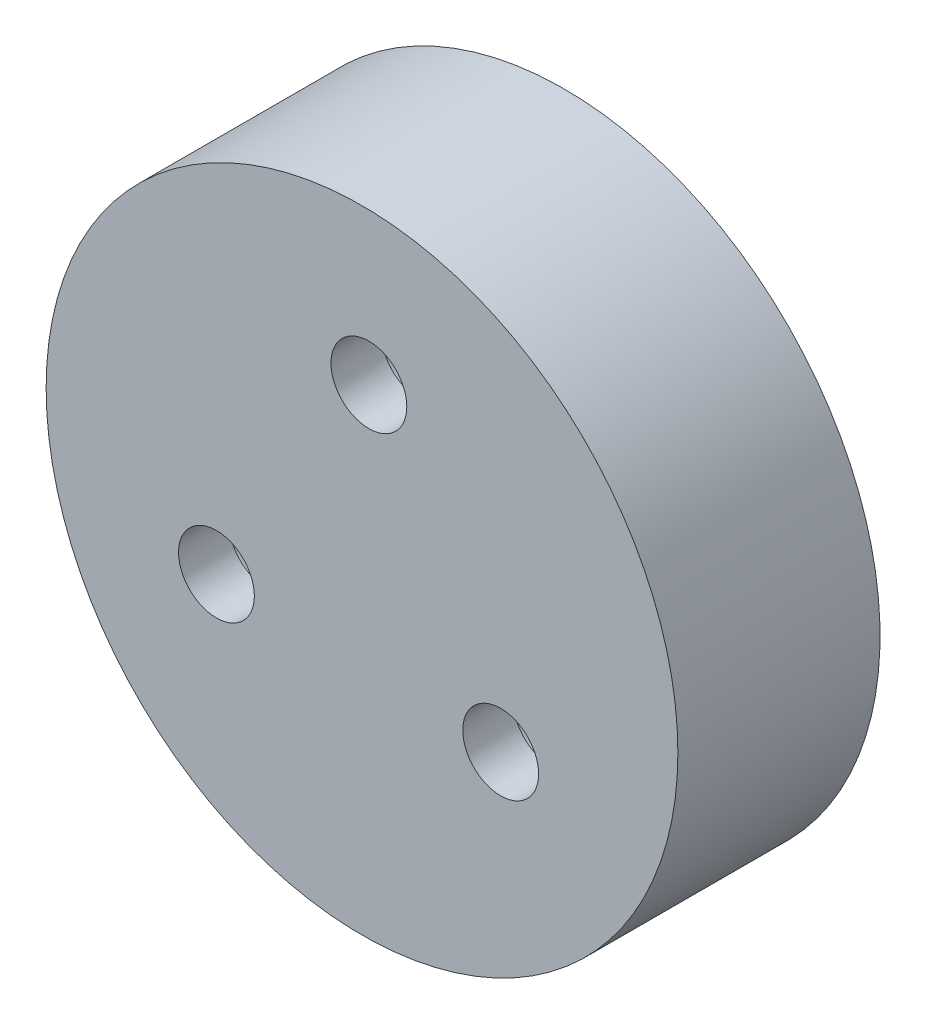
ISO-10303-21;
HEADER;
FILE_DESCRIPTION(('STEP AP214'),'2;1');
FILE_NAME('part.step','',(''),(''),'','','');
FILE_SCHEMA(('AUTOMOTIVE_DESIGN { 1 0 10303 214 1 1 1 1 }'));
ENDSEC;
DATA;
#1=APPLICATION_CONTEXT('core data for automotive mechanical design processes');
#2=APPLICATION_PROTOCOL_DEFINITION('international standard','automotive_design',2000,#1);
#3=PRODUCT_CONTEXT('',#1,'mechanical');
#4=PRODUCT('Part','Part','',(#3));
#5=PRODUCT_RELATED_PRODUCT_CATEGORY('part','',(#4));
#6=PRODUCT_DEFINITION_FORMATION('','',#4);
#7=PRODUCT_DEFINITION_CONTEXT('part definition',#1,'design');
#8=PRODUCT_DEFINITION('design','',#6,#7);
#9=PRODUCT_DEFINITION_SHAPE('','',#8);
#10=(LENGTH_UNIT() NAMED_UNIT(*) SI_UNIT(.MILLI.,.METRE.));
#11=(NAMED_UNIT(*) PLANE_ANGLE_UNIT() SI_UNIT($,.RADIAN.));
#12=(NAMED_UNIT(*) SI_UNIT($,.STERADIAN.) SOLID_ANGLE_UNIT());
#13=UNCERTAINTY_MEASURE_WITH_UNIT(LENGTH_MEASURE(1.E-05),#10,'distance_accuracy_value','');
#14=(GEOMETRIC_REPRESENTATION_CONTEXT(3) GLOBAL_UNCERTAINTY_ASSIGNED_CONTEXT((#13)) GLOBAL_UNIT_ASSIGNED_CONTEXT((#10,
#11,#12)) REPRESENTATION_CONTEXT('',''));
#15=CARTESIAN_POINT('',(0.,0.,0.));
#16=DIRECTION('',(0.,0.,1.));
#17=DIRECTION('',(1.,0.,0.));
#18=AXIS2_PLACEMENT_3D('',#15,#16,#17);
#19=CARTESIAN_POINT('',(-5.76029822902629,-3.0114721172006,15.));
#20=DIRECTION('',(0.,0.,-1.));
#21=DIRECTION('',(-1.,0.,0.));
#22=AXIS2_PLACEMENT_3D('',#19,#20,#21);
#23=CYLINDRICAL_SURFACE('',#22,1.5);
#24=CARTESIAN_POINT('',(-5.76029822902629,-3.0114721172006,6.));
#25=DIRECTION('',(0.,0.,1.));
#26=DIRECTION('',(1.,0.,0.));
#27=AXIS2_PLACEMENT_3D('',#24,#25,#26);
#28=CIRCLE('',#27,1.5);
#29=CARTESIAN_POINT('',(-4.26029822902629,-3.0114721172006,6.));
#30=VERTEX_POINT('',#29);
#31=EDGE_CURVE('E70',#30,#30,#28,.T.);
#32=ORIENTED_EDGE('',*,*,#31,.T.);
#33=EDGE_LOOP('',(#32));
#34=FACE_BOUND('',#33,.T.);
#35=CARTESIAN_POINT('',(-5.76029822902629,-3.0114721172006,4.));
#36=DIRECTION('',(0.,0.,-1.));
#37=DIRECTION('',(-1.,0.,0.));
#38=AXIS2_PLACEMENT_3D('',#35,#36,#37);
#39=CIRCLE('',#38,1.5);
#40=CARTESIAN_POINT('',(-7.26029822902629,-3.0114721172006,4.));
#41=VERTEX_POINT('',#40);
#42=EDGE_CURVE('E34',#41,#41,#39,.F.);
#43=ORIENTED_EDGE('',*,*,#42,.F.);
#44=EDGE_LOOP('',(#43));
#45=FACE_BOUND('',#44,.T.);
#46=ADVANCED_FACE('F30',(#34,#45),#23,.F.);
#47=CARTESIAN_POINT('',(5.48816047079737,-3.48282854111097,15.));
#48=DIRECTION('',(0.,0.,-1.));
#49=DIRECTION('',(-1.,0.,0.));
#50=AXIS2_PLACEMENT_3D('',#47,#48,#49);
#51=CYLINDRICAL_SURFACE('',#50,1.5);
#52=CARTESIAN_POINT('',(5.48816047079737,-3.48282854111097,6.));
#53=DIRECTION('',(0.,0.,1.));
#54=DIRECTION('',(1.,0.,0.));
#55=AXIS2_PLACEMENT_3D('',#52,#53,#54);
#56=CIRCLE('',#55,1.5);
#57=CARTESIAN_POINT('',(6.98816047079737,-3.48282854111097,6.));
#58=VERTEX_POINT('',#57);
#59=EDGE_CURVE('E43',#58,#58,#56,.T.);
#60=ORIENTED_EDGE('',*,*,#59,.T.);
#61=EDGE_LOOP('',(#60));
#62=FACE_BOUND('',#61,.T.);
#63=CARTESIAN_POINT('',(5.48816047079737,-3.48282854111097,4.));
#64=DIRECTION('',(0.,0.,-1.));
#65=DIRECTION('',(-1.,0.,0.));
#66=AXIS2_PLACEMENT_3D('',#63,#64,#65);
#67=CIRCLE('',#66,1.5);
#68=CARTESIAN_POINT('',(3.98816047079737,-3.48282854111097,4.));
#69=VERTEX_POINT('',#68);
#70=EDGE_CURVE('E49',#69,#69,#67,.F.);
#71=ORIENTED_EDGE('',*,*,#70,.F.);
#72=EDGE_LOOP('',(#71));
#73=FACE_BOUND('',#72,.T.);
#74=ADVANCED_FACE('F75',(#62,#73),#51,.F.);
#75=CARTESIAN_POINT('',(0.272137758228912,6.49430065831158,15.));
#76=DIRECTION('',(0.,0.,-1.));
#77=DIRECTION('',(-1.,0.,0.));
#78=AXIS2_PLACEMENT_3D('',#75,#76,#77);
#79=CYLINDRICAL_SURFACE('',#78,1.5);
#80=CARTESIAN_POINT('',(0.272137758228912,6.49430065831158,6.));
#81=DIRECTION('',(0.,0.,1.));
#82=DIRECTION('',(1.,0.,0.));
#83=AXIS2_PLACEMENT_3D('',#80,#81,#82);
#84=CIRCLE('',#83,1.5);
#85=CARTESIAN_POINT('',(1.77213775822891,6.49430065831158,6.));
#86=VERTEX_POINT('',#85);
#87=EDGE_CURVE('E38',#86,#86,#84,.T.);
#88=ORIENTED_EDGE('',*,*,#87,.T.);
#89=EDGE_LOOP('',(#88));
#90=FACE_BOUND('',#89,.T.);
#91=CARTESIAN_POINT('',(0.272137758228912,6.49430065831158,4.));
#92=DIRECTION('',(0.,0.,-1.));
#93=DIRECTION('',(-1.,0.,0.));
#94=AXIS2_PLACEMENT_3D('',#91,#92,#93);
#95=CIRCLE('',#94,1.5);
#96=CARTESIAN_POINT('',(-1.22786224177109,6.49430065831158,4.));
#97=VERTEX_POINT('',#96);
#98=EDGE_CURVE('E47',#97,#97,#95,.F.);
#99=ORIENTED_EDGE('',*,*,#98,.F.);
#100=EDGE_LOOP('',(#99));
#101=FACE_BOUND('',#100,.T.);
#102=ADVANCED_FACE('F92',(#90,#101),#79,.F.);
#103=CARTESIAN_POINT('',(0.,0.,0.));
#104=DIRECTION('',(0.,0.,1.));
#105=DIRECTION('',(1.,0.,0.));
#106=AXIS2_PLACEMENT_3D('',#103,#104,#105);
#107=PLANE('',#106);
#108=CARTESIAN_POINT('',(0.272137758228912,6.49430065831158,0.));
#109=DIRECTION('',(0.,0.,-1.));
#110=DIRECTION('',(-1.,0.,0.));
#111=AXIS2_PLACEMENT_3D('',#108,#109,#110);
#112=CIRCLE('',#111,2.5);
#113=CARTESIAN_POINT('',(-2.22786224177109,6.49430065831158,0.));
#114=VERTEX_POINT('',#113);
#115=EDGE_CURVE('E107',#114,#114,#112,.T.);
#116=ORIENTED_EDGE('',*,*,#115,.F.);
#117=EDGE_LOOP('',(#116));
#118=FACE_BOUND('',#117,.T.);
#119=CARTESIAN_POINT('',(-5.76029822902629,-3.0114721172006,0.));
#120=DIRECTION('',(0.,0.,-1.));
#121=DIRECTION('',(-1.,0.,0.));
#122=AXIS2_PLACEMENT_3D('',#119,#120,#121);
#123=CIRCLE('',#122,2.5);
#124=CARTESIAN_POINT('',(-8.26029822902629,-3.0114721172006,0.));
#125=VERTEX_POINT('',#124);
#126=EDGE_CURVE('E111',#125,#125,#123,.T.);
#127=ORIENTED_EDGE('',*,*,#126,.F.);
#128=EDGE_LOOP('',(#127));
#129=FACE_BOUND('',#128,.T.);
#130=CARTESIAN_POINT('',(5.48816047079737,-3.48282854111097,0.));
#131=DIRECTION('',(0.,0.,-1.));
#132=DIRECTION('',(-1.,0.,0.));
#133=AXIS2_PLACEMENT_3D('',#130,#131,#132);
#134=CIRCLE('',#133,2.5);
#135=CARTESIAN_POINT('',(2.98816047079737,-3.48282854111097,0.));
#136=VERTEX_POINT('',#135);
#137=EDGE_CURVE('E114',#136,#136,#134,.T.);
#138=ORIENTED_EDGE('',*,*,#137,.F.);
#139=EDGE_LOOP('',(#138));
#140=FACE_BOUND('',#139,.T.);
#141=CARTESIAN_POINT('',(0.,0.,0.));
#142=DIRECTION('',(0.,0.,-1.));
#143=DIRECTION('',(-1.,0.,0.));
#144=AXIS2_PLACEMENT_3D('',#141,#142,#143);
#145=CIRCLE('',#144,10.);
#146=CARTESIAN_POINT('',(-10.,0.,0.));
#147=VERTEX_POINT('',#146);
#148=EDGE_CURVE('E55',#147,#147,#145,.T.);
#149=ORIENTED_EDGE('',*,*,#148,.T.);
#150=EDGE_LOOP('',(#149));
#151=FACE_BOUND('',#150,.T.);
#152=ADVANCED_FACE('F95',(#118,#129,#140,#151),#107,.F.);
#153=CARTESIAN_POINT('',(0.,0.,6.));
#154=DIRECTION('',(0.,0.,-1.));
#155=DIRECTION('',(-1.,0.,0.));
#156=AXIS2_PLACEMENT_3D('',#153,#154,#155);
#157=CYLINDRICAL_SURFACE('',#156,12.5);
#158=CARTESIAN_POINT('',(0.,0.,6.));
#159=DIRECTION('',(0.,0.,1.));
#160=DIRECTION('',(1.,0.,0.));
#161=AXIS2_PLACEMENT_3D('',#158,#159,#160);
#162=CIRCLE('',#161,12.5);
#163=CARTESIAN_POINT('',(12.5,0.,6.));
#164=VERTEX_POINT('',#163);
#165=EDGE_CURVE('E10',#164,#164,#162,.T.);
#166=ORIENTED_EDGE('',*,*,#165,.F.);
#167=EDGE_LOOP('',(#166));
#168=FACE_BOUND('',#167,.T.);
#169=CARTESIAN_POINT('',(0.,0.,-2.));
#170=DIRECTION('',(0.,0.,-1.));
#171=DIRECTION('',(-1.,0.,0.));
#172=AXIS2_PLACEMENT_3D('',#169,#170,#171);
#173=CIRCLE('',#172,12.5);
#174=CARTESIAN_POINT('',(-12.5,0.,-2.));
#175=VERTEX_POINT('',#174);
#176=EDGE_CURVE('E64',#175,#175,#173,.T.);
#177=ORIENTED_EDGE('',*,*,#176,.F.);
#178=EDGE_LOOP('',(#177));
#179=FACE_BOUND('',#178,.T.);
#180=ADVANCED_FACE('F32',(#168,#179),#157,.T.);
#181=CARTESIAN_POINT('',(0.,0.,6.));
#182=DIRECTION('',(0.,0.,1.));
#183=DIRECTION('',(1.,0.,0.));
#184=AXIS2_PLACEMENT_3D('',#181,#182,#183);
#185=PLANE('',#184);
#186=ORIENTED_EDGE('',*,*,#87,.F.);
#187=EDGE_LOOP('',(#186));
#188=FACE_BOUND('',#187,.T.);
#189=ORIENTED_EDGE('',*,*,#59,.F.);
#190=EDGE_LOOP('',(#189));
#191=FACE_BOUND('',#190,.T.);
#192=ORIENTED_EDGE('',*,*,#31,.F.);
#193=EDGE_LOOP('',(#192));
#194=FACE_BOUND('',#193,.T.);
#195=ORIENTED_EDGE('',*,*,#165,.T.);
#196=EDGE_LOOP('',(#195));
#197=FACE_BOUND('',#196,.T.);
#198=ADVANCED_FACE('F78',(#188,#191,#194,#197),#185,.T.);
#199=CARTESIAN_POINT('',(0.,0.,-2.));
#200=DIRECTION('',(0.,0.,-1.));
#201=DIRECTION('',(-1.,0.,0.));
#202=AXIS2_PLACEMENT_3D('',#199,#200,#201);
#203=PLANE('',#202);
#204=ORIENTED_EDGE('',*,*,#176,.T.);
#205=EDGE_LOOP('',(#204));
#206=FACE_BOUND('',#205,.T.);
#207=CARTESIAN_POINT('',(0.,0.,-2.));
#208=DIRECTION('',(0.,0.,-1.));
#209=DIRECTION('',(-1.,0.,0.));
#210=AXIS2_PLACEMENT_3D('',#207,#208,#209);
#211=CIRCLE('',#210,10.);
#212=CARTESIAN_POINT('',(-10.,0.,-2.));
#213=VERTEX_POINT('',#212);
#214=EDGE_CURVE('E59',#213,#213,#211,.T.);
#215=ORIENTED_EDGE('',*,*,#214,.F.);
#216=EDGE_LOOP('',(#215));
#217=FACE_BOUND('',#216,.T.);
#218=ADVANCED_FACE('F81',(#206,#217),#203,.T.);
#219=CARTESIAN_POINT('',(0.,0.,-2.));
#220=DIRECTION('',(0.,0.,1.));
#221=DIRECTION('',(1.,0.,0.));
#222=AXIS2_PLACEMENT_3D('',#219,#220,#221);
#223=CYLINDRICAL_SURFACE('',#222,10.);
#224=ORIENTED_EDGE('',*,*,#214,.T.);
#225=EDGE_LOOP('',(#224));
#226=FACE_BOUND('',#225,.T.);
#227=ORIENTED_EDGE('',*,*,#148,.F.);
#228=EDGE_LOOP('',(#227));
#229=FACE_BOUND('',#228,.T.);
#230=ADVANCED_FACE('F143',(#226,#229),#223,.F.);
#231=CARTESIAN_POINT('',(0.272137758228912,6.49430065831158,4.));
#232=DIRECTION('',(0.,0.,-1.));
#233=DIRECTION('',(-1.,0.,0.));
#234=AXIS2_PLACEMENT_3D('',#231,#232,#233);
#235=PLANE('',#234);
#236=CARTESIAN_POINT('',(0.272137758228912,6.49430065831158,4.));
#237=DIRECTION('',(0.,0.,-1.));
#238=DIRECTION('',(-1.,0.,0.));
#239=AXIS2_PLACEMENT_3D('',#236,#237,#238);
#240=CIRCLE('',#239,2.5);
#241=CARTESIAN_POINT('',(-2.22786224177109,6.49430065831158,4.));
#242=VERTEX_POINT('',#241);
#243=EDGE_CURVE('E50',#242,#242,#240,.T.);
#244=ORIENTED_EDGE('',*,*,#243,.T.);
#245=EDGE_LOOP('',(#244));
#246=FACE_BOUND('',#245,.T.);
#247=ORIENTED_EDGE('',*,*,#98,.T.);
#248=EDGE_LOOP('',(#247));
#249=FACE_BOUND('',#248,.T.);
#250=ADVANCED_FACE('F128',(#246,#249),#235,.T.);
#251=CARTESIAN_POINT('',(0.272137758228912,6.49430065831158,4.));
#252=DIRECTION('',(0.,0.,-1.));
#253=DIRECTION('',(-1.,0.,0.));
#254=AXIS2_PLACEMENT_3D('',#251,#252,#253);
#255=CYLINDRICAL_SURFACE('',#254,2.5);
#256=ORIENTED_EDGE('',*,*,#243,.F.);
#257=EDGE_LOOP('',(#256));
#258=FACE_BOUND('',#257,.T.);
#259=ORIENTED_EDGE('',*,*,#115,.T.);
#260=EDGE_LOOP('',(#259));
#261=FACE_BOUND('',#260,.T.);
#262=ADVANCED_FACE('F131',(#258,#261),#255,.F.);
#263=CARTESIAN_POINT('',(5.48816047079737,-3.48282854111097,4.));
#264=DIRECTION('',(0.,0.,-1.));
#265=DIRECTION('',(-1.,0.,0.));
#266=AXIS2_PLACEMENT_3D('',#263,#264,#265);
#267=PLANE('',#266);
#268=CARTESIAN_POINT('',(5.48816047079737,-3.48282854111097,4.));
#269=DIRECTION('',(0.,0.,-1.));
#270=DIRECTION('',(-1.,0.,0.));
#271=AXIS2_PLACEMENT_3D('',#268,#269,#270);
#272=CIRCLE('',#271,2.5);
#273=CARTESIAN_POINT('',(2.98816047079737,-3.48282854111097,4.));
#274=VERTEX_POINT('',#273);
#275=EDGE_CURVE('E116',#274,#274,#272,.T.);
#276=ORIENTED_EDGE('',*,*,#275,.T.);
#277=EDGE_LOOP('',(#276));
#278=FACE_BOUND('',#277,.T.);
#279=ORIENTED_EDGE('',*,*,#70,.T.);
#280=EDGE_LOOP('',(#279));
#281=FACE_BOUND('',#280,.T.);
#282=ADVANCED_FACE('F134',(#278,#281),#267,.T.);
#283=CARTESIAN_POINT('',(5.48816047079737,-3.48282854111097,4.));
#284=DIRECTION('',(0.,0.,-1.));
#285=DIRECTION('',(-1.,0.,0.));
#286=AXIS2_PLACEMENT_3D('',#283,#284,#285);
#287=CYLINDRICAL_SURFACE('',#286,2.5);
#288=ORIENTED_EDGE('',*,*,#275,.F.);
#289=EDGE_LOOP('',(#288));
#290=FACE_BOUND('',#289,.T.);
#291=ORIENTED_EDGE('',*,*,#137,.T.);
#292=EDGE_LOOP('',(#291));
#293=FACE_BOUND('',#292,.T.);
#294=ADVANCED_FACE('F140',(#290,#293),#287,.F.);
#295=CARTESIAN_POINT('',(-5.76029822902629,-3.0114721172006,4.));
#296=DIRECTION('',(0.,0.,-1.));
#297=DIRECTION('',(-1.,0.,0.));
#298=AXIS2_PLACEMENT_3D('',#295,#296,#297);
#299=PLANE('',#298);
#300=CARTESIAN_POINT('',(-5.76029822902629,-3.0114721172006,4.));
#301=DIRECTION('',(0.,0.,-1.));
#302=DIRECTION('',(-1.,0.,0.));
#303=AXIS2_PLACEMENT_3D('',#300,#301,#302);
#304=CIRCLE('',#303,2.5);
#305=CARTESIAN_POINT('',(-8.26029822902629,-3.0114721172006,4.));
#306=VERTEX_POINT('',#305);
#307=EDGE_CURVE('E121',#306,#306,#304,.T.);
#308=ORIENTED_EDGE('',*,*,#307,.T.);
#309=EDGE_LOOP('',(#308));
#310=FACE_BOUND('',#309,.T.);
#311=ORIENTED_EDGE('',*,*,#42,.T.);
#312=EDGE_LOOP('',(#311));
#313=FACE_BOUND('',#312,.T.);
#314=ADVANCED_FACE('F146',(#310,#313),#299,.T.);
#315=CARTESIAN_POINT('',(-5.76029822902629,-3.0114721172006,4.));
#316=DIRECTION('',(0.,0.,-1.));
#317=DIRECTION('',(-1.,0.,0.));
#318=AXIS2_PLACEMENT_3D('',#315,#316,#317);
#319=CYLINDRICAL_SURFACE('',#318,2.5);
#320=ORIENTED_EDGE('',*,*,#307,.F.);
#321=EDGE_LOOP('',(#320));
#322=FACE_BOUND('',#321,.T.);
#323=ORIENTED_EDGE('',*,*,#126,.T.);
#324=EDGE_LOOP('',(#323));
#325=FACE_BOUND('',#324,.T.);
#326=ADVANCED_FACE('F149',(#322,#325),#319,.F.);
#327=CLOSED_SHELL('',(#46,#74,#102,#152,#180,#198,#218,#230,#250,#262,#282,#294,#314,#326));
#328=MANIFOLD_SOLID_BREP('B2',#327);
#329=ADVANCED_BREP_SHAPE_REPRESENTATION('',(#18,#328),#14);
#330=SHAPE_DEFINITION_REPRESENTATION(#9,#329);
ENDSEC;
END-ISO-10303-21;
